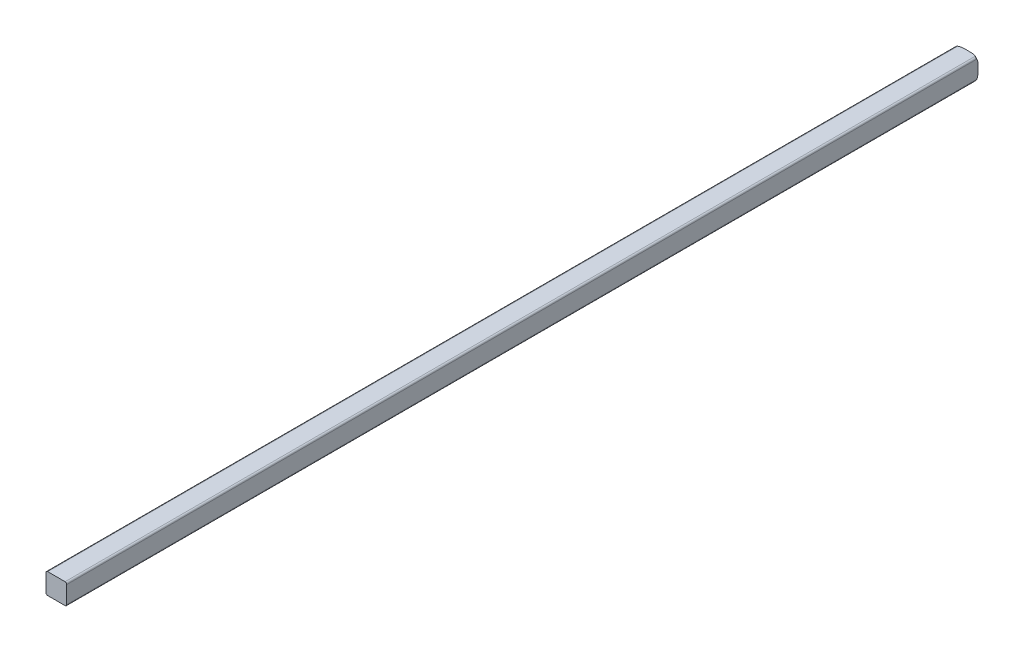
ISO-10303-21;
HEADER;
FILE_DESCRIPTION(('STEP AP214'),'2;1');
FILE_NAME('part.step','',(''),(''),'','','');
FILE_SCHEMA(('AUTOMOTIVE_DESIGN { 1 0 10303 214 1 1 1 1 }'));
ENDSEC;
DATA;
#1=APPLICATION_CONTEXT('core data for automotive mechanical design processes');
#2=APPLICATION_PROTOCOL_DEFINITION('international standard','automotive_design',2000,#1);
#3=PRODUCT_CONTEXT('',#1,'mechanical');
#4=PRODUCT('Part','Part','',(#3));
#5=PRODUCT_RELATED_PRODUCT_CATEGORY('part','',(#4));
#6=PRODUCT_DEFINITION_FORMATION('','',#4);
#7=PRODUCT_DEFINITION_CONTEXT('part definition',#1,'design');
#8=PRODUCT_DEFINITION('design','',#6,#7);
#9=PRODUCT_DEFINITION_SHAPE('','',#8);
#10=(LENGTH_UNIT() NAMED_UNIT(*) SI_UNIT(.MILLI.,.METRE.));
#11=(NAMED_UNIT(*) PLANE_ANGLE_UNIT() SI_UNIT($,.RADIAN.));
#12=(NAMED_UNIT(*) SI_UNIT($,.STERADIAN.) SOLID_ANGLE_UNIT());
#13=UNCERTAINTY_MEASURE_WITH_UNIT(LENGTH_MEASURE(1.E-05),#10,'distance_accuracy_value','');
#14=(GEOMETRIC_REPRESENTATION_CONTEXT(3) GLOBAL_UNCERTAINTY_ASSIGNED_CONTEXT((#13)) GLOBAL_UNIT_ASSIGNED_CONTEXT((#10,
#11,#12)) REPRESENTATION_CONTEXT('',''));
#15=CARTESIAN_POINT('',(0.,0.,0.));
#16=DIRECTION('',(0.,0.,1.));
#17=DIRECTION('',(1.,0.,0.));
#18=AXIS2_PLACEMENT_3D('',#15,#16,#17);
#19=CARTESIAN_POINT('',(0.,0.,-151.765));
#20=DIRECTION('',(0.,0.,1.));
#21=DIRECTION('',(1.,0.,0.));
#22=AXIS2_PLACEMENT_3D('',#19,#20,#21);
#23=TOROIDAL_SURFACE('',#22,1.63185378542452,0.634999999999996);
#24=CARTESIAN_POINT('',(1.5875,-1.33350000000002,-152.221499318016));
#25=CARTESIAN_POINT('',(1.58748566897288,-1.34690792462913,-152.213190238344));
#26=CARTESIAN_POINT('',(1.58643563491714,-1.36046268636275,-152.204973203089));
#27=CARTESIAN_POINT('',(1.58201648662521,-1.38783838491251,-152.189246987089));
#28=CARTESIAN_POINT('',(1.57861670279278,-1.40166046367848,-152.181748678998));
#29=CARTESIAN_POINT('',(1.57058714220896,-1.4252188046148,-152.170181353723));
#30=CARTESIAN_POINT('',(1.56659229292944,-1.43498690476736,-152.165746278129));
#31=CARTESIAN_POINT('',(1.55721249958347,-1.45425932377617,-152.158001433052));
#32=CARTESIAN_POINT('',(1.55183414419048,-1.46376466264462,-152.154686497667));
#33=CARTESIAN_POINT('',(1.54064277647373,-1.48078992954893,-152.14994940311));
#34=CARTESIAN_POINT('',(1.53503704758616,-1.48838416094885,-152.148309241859));
#35=CARTESIAN_POINT('',(1.52291375209377,-1.50299443314631,-152.146252977872));
#36=CARTESIAN_POINT('',(1.51639639905189,-1.51001060875298,-152.145836588948));
#37=CARTESIAN_POINT('',(1.50263078678935,-1.52324184577942,-152.146280429597));
#38=CARTESIAN_POINT('',(1.49538231587763,-1.52945667397997,-152.14714102991));
#39=CARTESIAN_POINT('',(1.48038761855588,-1.54093535352862,-152.150033976363));
#40=CARTESIAN_POINT('',(1.47264109349684,-1.54619862694723,-152.152067031478));
#41=CARTESIAN_POINT('',(1.45446300659162,-1.5571701281181,-152.157864814596));
#42=CARTESIAN_POINT('',(1.44392996611574,-1.56252875091595,-152.161967806468));
#43=CARTESIAN_POINT('',(1.42264994892329,-1.57162418246107,-152.171336771351));
#44=CARTESIAN_POINT('',(1.41190224866778,-1.57535394035416,-152.176607654423));
#45=CARTESIAN_POINT('',(1.38976321513481,-1.58147222213898,-152.188219245468));
#46=CARTESIAN_POINT('',(1.37837092259127,-1.58376977522872,-152.194604434648));
#47=CARTESIAN_POINT('',(1.3557914101953,-1.58677095199112,-152.207801324842));
#48=CARTESIAN_POINT('',(1.34460332096514,-1.58749208945789,-152.214607466425));
#49=CARTESIAN_POINT('',(1.3335,-1.5875,-152.221499318016));
#50=B_SPLINE_CURVE_WITH_KNOTS('',3,(#24,#25,#26,#27,#28,#29,#30,#31,#32,#33,#34,#35,#36,#37,#38,
#39,#40,#41,#42,#43,#44,#45,#46,#47,#48,#49),.UNSPECIFIED.,.F.,.F.,(4,2,2,2,2,2,2,2,2,2,2,2,4),
(0.,0.0474135575383086,0.0954579548319941,0.129685196647684,0.163752362077388,0.192367952546173,
0.220976850534813,0.249594055977996,0.278228584196791,0.315551990426705,0.35303539436927,
0.392706187180639,0.431933953270491),.UNSPECIFIED.);
#51=CARTESIAN_POINT('',(1.58749999999933,-1.33349999999976,-152.221499318016));
#52=VERTEX_POINT('',#51);
#53=CARTESIAN_POINT('',(1.3335,-1.5875,-152.221499318016));
#54=VERTEX_POINT('',#53);
#55=EDGE_CURVE('E138',#52,#54,#50,.T.);
#56=ORIENTED_EDGE('',*,*,#55,.T.);
#57=CARTESIAN_POINT('',(1.3335,-1.5875,-152.221499318016));
#58=CARTESIAN_POINT('',(1.31039310118339,-1.5875,-152.235865299563));
#59=CARTESIAN_POINT('',(1.2865956642968,-1.5875,-152.249048257601));
#60=CARTESIAN_POINT('',(1.23796868030272,-1.5875,-152.273223560389));
#61=CARTESIAN_POINT('',(1.21314134560693,-1.5875,-152.284220334021));
#62=CARTESIAN_POINT('',(1.13821413543875,-1.5875,-152.313985593762));
#63=CARTESIAN_POINT('',(1.08698851455543,-1.58749999999999,-152.329928851037));
#64=CARTESIAN_POINT('',(0.999962751237773,-1.5875,-152.351585586061));
#65=CARTESIAN_POINT('',(0.964535612838002,-1.5875,-152.358939888529));
#66=CARTESIAN_POINT('',(0.893247688923875,-1.5875,-152.371383880132));
#67=CARTESIAN_POINT('',(0.857386498395738,-1.5875,-152.376471254534));
#68=CARTESIAN_POINT('',(0.785399533338715,-1.5875,-152.384831387066));
#69=CARTESIAN_POINT('',(0.749273402082702,-1.5875,-152.388100907212));
#70=CARTESIAN_POINT('',(0.67580173022745,-1.5875,-152.393318963833));
#71=CARTESIAN_POINT('',(0.63845318438633,-1.5875,-152.395223289793));
#72=CARTESIAN_POINT('',(0.563797247200005,-1.5875,-152.397971889239));
#73=CARTESIAN_POINT('',(0.526489923948469,-1.5875,-152.398818284985));
#74=CARTESIAN_POINT('',(0.452078339022184,-1.5875,-152.399825627271));
#75=CARTESIAN_POINT('',(0.414974136365072,-1.5875,-152.399990466567));
#76=CARTESIAN_POINT('',(0.377876338243535,-1.5875,-152.4));
#77=B_SPLINE_CURVE_WITH_KNOTS('',3,(#57,#58,#59,#60,#61,#62,#63,#64,#65,#66,#67,#68,#69,#70,#71,
#72,#73,#74,#75,#76),.UNSPECIFIED.,.F.,.F.,(4,2,2,2,2,2,2,2,2,4),(0.,0.081532624795922,
0.162898354774411,0.323290286001692,0.431774886900742,0.54037000765597,0.649157944635809,
0.761326732026143,0.873270140095039,0.984573284944613),.UNSPECIFIED.);
#78=CARTESIAN_POINT('',(0.377876338243536,-1.5875,-152.4));
#79=VERTEX_POINT('',#78);
#80=EDGE_CURVE('E143',#54,#79,#77,.T.);
#81=ORIENTED_EDGE('',*,*,#80,.T.);
#82=CARTESIAN_POINT('',(0.,0.,-152.4));
#83=DIRECTION('',(0.,0.,1.));
#84=DIRECTION('',(0.231562620143221,-0.97282000028392,0.));
#85=AXIS2_PLACEMENT_3D('',#82,#83,#84);
#86=CIRCLE('',#85,1.63185378542452);
#87=CARTESIAN_POINT('',(1.5875,-0.377876338243537,-152.4));
#88=VERTEX_POINT('',#87);
#89=EDGE_CURVE('E123',#88,#79,#86,.F.);
#90=ORIENTED_EDGE('',*,*,#89,.F.);
#91=CARTESIAN_POINT('',(1.5875,-0.377876338243537,-152.4));
#92=CARTESIAN_POINT('',(1.5875,-0.411612509119624,-152.399993375156));
#93=CARTESIAN_POINT('',(1.5875,-0.445352736805654,-152.399855790265));
#94=CARTESIAN_POINT('',(1.5875,-0.512942907948323,-152.399047840727));
#95=CARTESIAN_POINT('',(1.5875,-0.546792826939158,-152.39837563363));
#96=CARTESIAN_POINT('',(1.5875,-0.614509507764874,-152.396222630311));
#97=CARTESIAN_POINT('',(1.5875,-0.648376243547024,-152.39474089648));
#98=CARTESIAN_POINT('',(1.5875,-0.715189437993939,-152.390705632448));
#99=CARTESIAN_POINT('',(1.5875,-0.748137535690094,-152.388180118227));
#100=CARTESIAN_POINT('',(1.5875,-0.813874511250838,-152.381749739949));
#101=CARTESIAN_POINT('',(1.5875,-0.846663515341609,-152.377846257093));
#102=CARTESIAN_POINT('',(1.5875,-0.911972001446362,-152.368328243334));
#103=CARTESIAN_POINT('',(1.5875,-0.944491567482057,-152.362714268179));
#104=CARTESIAN_POINT('',(1.58750000000001,-1.03884990510625,-152.343295735213));
#105=CARTESIAN_POINT('',(1.58750000000004,-1.10020590566775,-152.326702751592));
#106=CARTESIAN_POINT('',(1.58749999999999,-1.17979261140477,-152.297655047337));
#107=CARTESIAN_POINT('',(1.58749999999997,-1.19970518510335,-152.289722358069));
#108=CARTESIAN_POINT('',(1.58750000000004,-1.23899757921714,-152.272570532428));
#109=CARTESIAN_POINT('',(1.58750000000013,-1.25837690634234,-152.263350249863));
#110=CARTESIAN_POINT('',(1.58749999999987,-1.29648737036626,-152.243502020843));
#111=CARTESIAN_POINT('',(1.58749999999952,-1.31521592279952,-152.232869126592));
#112=CARTESIAN_POINT('',(1.58749999999867,-1.3334999999995,-152.221499318017));
#113=B_SPLINE_CURVE_WITH_KNOTS('',3,(#91,#92,#93,#94,#95,#96,#97,#98,#99,#100,#101,#102,#103,
#104,#105,#106,#107,#108,#109,#110,#111,#112),.UNSPECIFIED.,.F.,.F.,(4,2,2,2,2,2,2,2,2,2,4),(0.,
0.10121457886963,0.202779489233483,0.304462283979961,0.40357684120048,0.502592332234137,
0.601575686961515,0.791402246158581,0.855672419606404,0.920000174261184,0.984559494506425),.UNSPECIFIED.);
#114=EDGE_CURVE('E84',#88,#52,#113,.T.);
#115=ORIENTED_EDGE('',*,*,#114,.T.);
#116=EDGE_LOOP('',(#56,#81,#90,#115));
#117=FACE_BOUND('',#116,.T.);
#118=ADVANCED_FACE('F32',(#117),#23,.T.);
#119=CARTESIAN_POINT('',(0.,0.,-151.765));
#120=DIRECTION('',(0.,0.,1.));
#121=DIRECTION('',(1.,0.,0.));
#122=AXIS2_PLACEMENT_3D('',#119,#120,#121);
#123=TOROIDAL_SURFACE('',#122,1.63185378542452,0.634999999999996);
#124=CARTESIAN_POINT('',(-1.33350000000002,-1.5875,-152.221499318016));
#125=CARTESIAN_POINT('',(-1.34690792462915,-1.58748566897288,-152.213190238344));
#126=CARTESIAN_POINT('',(-1.36046268636276,-1.58643563491714,-152.204973203089));
#127=CARTESIAN_POINT('',(-1.38783838491252,-1.5820164866252,-152.189246987089));
#128=CARTESIAN_POINT('',(-1.40166046367848,-1.57861670279278,-152.181748678998));
#129=CARTESIAN_POINT('',(-1.42521880461481,-1.57058714220896,-152.170181353723));
#130=CARTESIAN_POINT('',(-1.43498690476737,-1.56659229292943,-152.165746278129));
#131=CARTESIAN_POINT('',(-1.45425932377618,-1.55721249958346,-152.158001433052));
#132=CARTESIAN_POINT('',(-1.46376466264463,-1.55183414419047,-152.154686497667));
#133=CARTESIAN_POINT('',(-1.48078992954893,-1.54064277647373,-152.14994940311));
#134=CARTESIAN_POINT('',(-1.48838416094885,-1.53503704758616,-152.148309241859));
#135=CARTESIAN_POINT('',(-1.50299443314631,-1.52291375209376,-152.146252977872));
#136=CARTESIAN_POINT('',(-1.51001060875298,-1.51639639905189,-152.145836588948));
#137=CARTESIAN_POINT('',(-1.52324184577942,-1.50263078678935,-152.146280429597));
#138=CARTESIAN_POINT('',(-1.52945667397997,-1.49538231587763,-152.14714102991));
#139=CARTESIAN_POINT('',(-1.54093535352862,-1.48038761855588,-152.150033976363));
#140=CARTESIAN_POINT('',(-1.54619862694723,-1.47264109349684,-152.152067031478));
#141=CARTESIAN_POINT('',(-1.5571701281181,-1.45446300659162,-152.157864814596));
#142=CARTESIAN_POINT('',(-1.56252875091595,-1.44392996611573,-152.161967806468));
#143=CARTESIAN_POINT('',(-1.57162418246107,-1.42264994892329,-152.171336771351));
#144=CARTESIAN_POINT('',(-1.57535394035416,-1.41190224866778,-152.176607654423));
#145=CARTESIAN_POINT('',(-1.58147222213898,-1.38976321513481,-152.188219245468));
#146=CARTESIAN_POINT('',(-1.58376977522872,-1.37837092259127,-152.194604434648));
#147=CARTESIAN_POINT('',(-1.58677095199112,-1.35579141019531,-152.207801324842));
#148=CARTESIAN_POINT('',(-1.58749208945789,-1.34460332096514,-152.214607466425));
#149=CARTESIAN_POINT('',(-1.5875,-1.3335,-152.221499318016));
#150=B_SPLINE_CURVE_WITH_KNOTS('',3,(#124,#125,#126,#127,#128,#129,#130,#131,#132,#133,#134,
#135,#136,#137,#138,#139,#140,#141,#142,#143,#144,#145,#146,#147,#148,#149),.UNSPECIFIED.,.F.,
.F.,(4,2,2,2,2,2,2,2,2,2,2,2,4),(0.,0.0474135575383209,0.0954579548320188,0.129685196647701,
0.163752362077393,0.192367952546176,0.220976850534816,0.249594055977999,0.278228584196793,
0.315551990426707,0.353035394369273,0.392706187180639,0.431933953270492),.UNSPECIFIED.);
#151=CARTESIAN_POINT('',(-1.33349999999976,-1.58749999999933,-152.221499318016));
#152=VERTEX_POINT('',#151);
#153=CARTESIAN_POINT('',(-1.5875,-1.3335,-152.221499318016));
#154=VERTEX_POINT('',#153);
#155=EDGE_CURVE('E306',#152,#154,#150,.T.);
#156=ORIENTED_EDGE('',*,*,#155,.T.);
#157=CARTESIAN_POINT('',(-1.5875,-1.3335,-152.221499318016));
#158=CARTESIAN_POINT('',(-1.5875,-1.31039310118339,-152.235865299563));
#159=CARTESIAN_POINT('',(-1.5875,-1.2865956642968,-152.249048257601));
#160=CARTESIAN_POINT('',(-1.5875,-1.23796868030272,-152.273223560389));
#161=CARTESIAN_POINT('',(-1.5875,-1.21314134560693,-152.284220334021));
#162=CARTESIAN_POINT('',(-1.5875,-1.13821413543875,-152.313985593762));
#163=CARTESIAN_POINT('',(-1.5875,-1.08698851455543,-152.329928851037));
#164=CARTESIAN_POINT('',(-1.5875,-0.999962751237773,-152.351585586061));
#165=CARTESIAN_POINT('',(-1.5875,-0.964535612838002,-152.358939888529));
#166=CARTESIAN_POINT('',(-1.5875,-0.893247688923874,-152.371383880132));
#167=CARTESIAN_POINT('',(-1.5875,-0.857386498395734,-152.376471254534));
#168=CARTESIAN_POINT('',(-1.5875,-0.785399533338711,-152.384831387066));
#169=CARTESIAN_POINT('',(-1.5875,-0.7492734020827,-152.388100907212));
#170=CARTESIAN_POINT('',(-1.5875,-0.675801730227451,-152.393318963833));
#171=CARTESIAN_POINT('',(-1.5875,-0.63845318438633,-152.395223289793));
#172=CARTESIAN_POINT('',(-1.5875,-0.563797247200005,-152.397971889239));
#173=CARTESIAN_POINT('',(-1.5875,-0.526489923948469,-152.398818284985));
#174=CARTESIAN_POINT('',(-1.5875,-0.452078339022184,-152.399825627271));
#175=CARTESIAN_POINT('',(-1.5875,-0.414974136365072,-152.399990466567));
#176=CARTESIAN_POINT('',(-1.5875,-0.377876338243535,-152.4));
#177=B_SPLINE_CURVE_WITH_KNOTS('',3,(#157,#158,#159,#160,#161,#162,#163,#164,#165,#166,#167,
#168,#169,#170,#171,#172,#173,#174,#175,#176),.UNSPECIFIED.,.F.,.F.,(4,2,2,2,2,2,2,2,2,4),(0.,
0.0815326247959219,0.162898354774411,0.323290286001692,0.431774886900742,0.54037000765597,
0.649157944635808,0.761326732026142,0.873270140095037,0.984573284944611),.UNSPECIFIED.);
#178=CARTESIAN_POINT('',(-1.5875,-0.377876338243537,-152.4));
#179=VERTEX_POINT('',#178);
#180=EDGE_CURVE('E305',#154,#179,#177,.T.);
#181=ORIENTED_EDGE('',*,*,#180,.T.);
#182=CARTESIAN_POINT('',(0.,0.,-152.4));
#183=DIRECTION('',(0.,0.,1.));
#184=DIRECTION('',(-0.97282000028392,-0.231562620143221,0.));
#185=AXIS2_PLACEMENT_3D('',#182,#183,#184);
#186=CIRCLE('',#185,1.63185378542452);
#187=CARTESIAN_POINT('',(-0.377876338243537,-1.5875,-152.4));
#188=VERTEX_POINT('',#187);
#189=EDGE_CURVE('E198',#188,#179,#186,.F.);
#190=ORIENTED_EDGE('',*,*,#189,.F.);
#191=CARTESIAN_POINT('',(-0.377876338243537,-1.5875,-152.4));
#192=CARTESIAN_POINT('',(-0.411612509119624,-1.5875,-152.399993375156));
#193=CARTESIAN_POINT('',(-0.445352736805654,-1.5875,-152.399855790265));
#194=CARTESIAN_POINT('',(-0.512942907948323,-1.5875,-152.399047840727));
#195=CARTESIAN_POINT('',(-0.546792826939158,-1.5875,-152.39837563363));
#196=CARTESIAN_POINT('',(-0.614509507764873,-1.5875,-152.396222630311));
#197=CARTESIAN_POINT('',(-0.648376243547024,-1.5875,-152.39474089648));
#198=CARTESIAN_POINT('',(-0.715189437993939,-1.5875,-152.390705632448));
#199=CARTESIAN_POINT('',(-0.748137535690094,-1.5875,-152.388180118227));
#200=CARTESIAN_POINT('',(-0.813874511250838,-1.5875,-152.381749739949));
#201=CARTESIAN_POINT('',(-0.846663515341609,-1.5875,-152.377846257093));
#202=CARTESIAN_POINT('',(-0.911972001446362,-1.5875,-152.368328243334));
#203=CARTESIAN_POINT('',(-0.944491567482057,-1.5875,-152.362714268179));
#204=CARTESIAN_POINT('',(-1.03884990510625,-1.58750000000001,-152.343295735213));
#205=CARTESIAN_POINT('',(-1.10020590566775,-1.58750000000004,-152.326702751592));
#206=CARTESIAN_POINT('',(-1.17979261140477,-1.58749999999999,-152.297655047337));
#207=CARTESIAN_POINT('',(-1.19970518510335,-1.58749999999997,-152.289722358069));
#208=CARTESIAN_POINT('',(-1.23899757921714,-1.58750000000004,-152.272570532428));
#209=CARTESIAN_POINT('',(-1.25837690634234,-1.58750000000013,-152.263350249863));
#210=CARTESIAN_POINT('',(-1.29648737036626,-1.58749999999987,-152.243502020843));
#211=CARTESIAN_POINT('',(-1.31521592279952,-1.58749999999952,-152.232869126592));
#212=CARTESIAN_POINT('',(-1.3334999999995,-1.58749999999867,-152.221499318017));
#213=B_SPLINE_CURVE_WITH_KNOTS('',3,(#191,#192,#193,#194,#195,#196,#197,#198,#199,#200,#201,
#202,#203,#204,#205,#206,#207,#208,#209,#210,#211,#212),.UNSPECIFIED.,.F.,.F.,(4,2,2,2,2,2,2,2,
2,2,4),(0.,0.10121457886963,0.202779489233483,0.304462283979962,0.40357684120048,
0.502592332234137,0.601575686961515,0.791402246158581,0.855672419606404,0.920000174261183,
0.984559494506424),.UNSPECIFIED.);
#214=EDGE_CURVE('E313',#188,#152,#213,.T.);
#215=ORIENTED_EDGE('',*,*,#214,.T.);
#216=EDGE_LOOP('',(#156,#181,#190,#215));
#217=FACE_BOUND('',#216,.T.);
#218=ADVANCED_FACE('F259',(#217),#123,.T.);
#219=CARTESIAN_POINT('',(0.,0.,-151.765));
#220=DIRECTION('',(0.,0.,1.));
#221=DIRECTION('',(1.,0.,0.));
#222=AXIS2_PLACEMENT_3D('',#219,#220,#221);
#223=TOROIDAL_SURFACE('',#222,1.63185378542452,0.634999999999996);
#224=CARTESIAN_POINT('',(0.,0.,-152.4));
#225=DIRECTION('',(0.,0.,1.));
#226=DIRECTION('',(-0.231562620143221,0.97282000028392,0.));
#227=AXIS2_PLACEMENT_3D('',#224,#225,#226);
#228=CIRCLE('',#227,1.63185378542452);
#229=CARTESIAN_POINT('',(-1.5875,0.377876338243537,-152.4));
#230=VERTEX_POINT('',#229);
#231=CARTESIAN_POINT('',(-0.377876338243537,1.5875,-152.4));
#232=VERTEX_POINT('',#231);
#233=EDGE_CURVE('E211',#230,#232,#228,.F.);
#234=ORIENTED_EDGE('',*,*,#233,.F.);
#235=CARTESIAN_POINT('',(-1.5875,0.377876338243537,-152.4));
#236=CARTESIAN_POINT('',(-1.5875,0.411612509119624,-152.399993375156));
#237=CARTESIAN_POINT('',(-1.5875,0.445352736805655,-152.399855790265));
#238=CARTESIAN_POINT('',(-1.5875,0.512942907948324,-152.399047840727));
#239=CARTESIAN_POINT('',(-1.5875,0.54679282693916,-152.39837563363));
#240=CARTESIAN_POINT('',(-1.5875,0.614509507764876,-152.396222630311));
#241=CARTESIAN_POINT('',(-1.5875,0.648376243547026,-152.39474089648));
#242=CARTESIAN_POINT('',(-1.5875,0.715189437993942,-152.390705632448));
#243=CARTESIAN_POINT('',(-1.5875,0.748137535690097,-152.388180118227));
#244=CARTESIAN_POINT('',(-1.5875,0.813874511250842,-152.381749739949));
#245=CARTESIAN_POINT('',(-1.5875,0.846663515341613,-152.377846257093));
#246=CARTESIAN_POINT('',(-1.5875,0.911972001446366,-152.368328243334));
#247=CARTESIAN_POINT('',(-1.5875,0.944491567482061,-152.362714268179));
#248=CARTESIAN_POINT('',(-1.58750000000001,1.03884990510625,-152.343295735213));
#249=CARTESIAN_POINT('',(-1.58750000000004,1.10020590566775,-152.326702751592));
#250=CARTESIAN_POINT('',(-1.58749999999999,1.17979261140477,-152.297655047337));
#251=CARTESIAN_POINT('',(-1.58749999999997,1.19970518510335,-152.289722358069));
#252=CARTESIAN_POINT('',(-1.58750000000004,1.23899757921714,-152.272570532428));
#253=CARTESIAN_POINT('',(-1.58750000000013,1.25837690634234,-152.263350249863));
#254=CARTESIAN_POINT('',(-1.58749999999987,1.29648737036626,-152.243502020843));
#255=CARTESIAN_POINT('',(-1.58749999999952,1.31521592279952,-152.232869126592));
#256=CARTESIAN_POINT('',(-1.58749999999867,1.3334999999995,-152.221499318017));
#257=B_SPLINE_CURVE_WITH_KNOTS('',3,(#235,#236,#237,#238,#239,#240,#241,#242,#243,#244,#245,
#246,#247,#248,#249,#250,#251,#252,#253,#254,#255,#256),.UNSPECIFIED.,.F.,.F.,(4,2,2,2,2,2,2,2,
2,2,4),(0.,0.101214578869631,0.202779489233485,0.304462283979964,0.403576841200483,
0.502592332234141,0.60157568696152,0.791402246158581,0.855672419606402,0.920000174261184,
0.98455949450642),.UNSPECIFIED.);
#258=CARTESIAN_POINT('',(-1.58749999999933,1.33349999999976,-152.221499318016));
#259=VERTEX_POINT('',#258);
#260=EDGE_CURVE('E131',#230,#259,#257,.T.);
#261=ORIENTED_EDGE('',*,*,#260,.T.);
#262=CARTESIAN_POINT('',(-1.5875,1.33350000000001,-152.221499318016));
#263=CARTESIAN_POINT('',(-1.58748566897288,1.34690792462914,-152.213190238344));
#264=CARTESIAN_POINT('',(-1.58643563491714,1.36046268636276,-152.204973203089));
#265=CARTESIAN_POINT('',(-1.5820164866252,1.38783838491252,-152.189246987089));
#266=CARTESIAN_POINT('',(-1.57861670279278,1.40166046367848,-152.181748678998));
#267=CARTESIAN_POINT('',(-1.57058714220896,1.42521880461481,-152.170181353723));
#268=CARTESIAN_POINT('',(-1.56659229292943,1.43498690476737,-152.165746278129));
#269=CARTESIAN_POINT('',(-1.55721249958346,1.45425932377618,-152.158001433052));
#270=CARTESIAN_POINT('',(-1.55183414419047,1.46376466264463,-152.154686497667));
#271=CARTESIAN_POINT('',(-1.54064277647373,1.48078992954893,-152.14994940311));
#272=CARTESIAN_POINT('',(-1.53503704758616,1.48838416094885,-152.148309241859));
#273=CARTESIAN_POINT('',(-1.52291375209377,1.50299443314631,-152.146252977872));
#274=CARTESIAN_POINT('',(-1.51639639905189,1.51001060875298,-152.145836588948));
#275=CARTESIAN_POINT('',(-1.50263078678935,1.52324184577942,-152.146280429597));
#276=CARTESIAN_POINT('',(-1.49538231587763,1.52945667397997,-152.14714102991));
#277=CARTESIAN_POINT('',(-1.48038761855588,1.54093535352862,-152.150033976363));
#278=CARTESIAN_POINT('',(-1.47264109349684,1.54619862694723,-152.152067031478));
#279=CARTESIAN_POINT('',(-1.45446300659162,1.5571701281181,-152.157864814596));
#280=CARTESIAN_POINT('',(-1.44392996611573,1.56252875091595,-152.161967806468));
#281=CARTESIAN_POINT('',(-1.42264994892329,1.57162418246107,-152.171336771351));
#282=CARTESIAN_POINT('',(-1.41190224866778,1.57535394035416,-152.176607654423));
#283=CARTESIAN_POINT('',(-1.38976321513481,1.58147222213898,-152.188219245468));
#284=CARTESIAN_POINT('',(-1.37837092259127,1.58376977522872,-152.194604434648));
#285=CARTESIAN_POINT('',(-1.35579141019531,1.58677095199112,-152.207801324842));
#286=CARTESIAN_POINT('',(-1.34460332096514,1.58749208945789,-152.214607466425));
#287=CARTESIAN_POINT('',(-1.3335,1.5875,-152.221499318016));
#288=B_SPLINE_CURVE_WITH_KNOTS('',3,(#262,#263,#264,#265,#266,#267,#268,#269,#270,#271,#272,
#273,#274,#275,#276,#277,#278,#279,#280,#281,#282,#283,#284,#285,#286,#287),.UNSPECIFIED.,.F.,
.F.,(4,2,2,2,2,2,2,2,2,2,2,2,4),(0.,0.0474135575383211,0.0954579548320196,0.129685196647705,
0.163752362077394,0.192367952546178,0.220976850534818,0.249594055978,0.278228584196795,
0.315551990426712,0.353035394369274,0.392706187180643,0.431933953270495),.UNSPECIFIED.);
#289=CARTESIAN_POINT('',(-1.3335,1.5875,-152.221499318016));
#290=VERTEX_POINT('',#289);
#291=EDGE_CURVE('E369',#259,#290,#288,.T.);
#292=ORIENTED_EDGE('',*,*,#291,.T.);
#293=CARTESIAN_POINT('',(-1.3335,1.5875,-152.221499318016));
#294=CARTESIAN_POINT('',(-1.31039310118339,1.5875,-152.235865299563));
#295=CARTESIAN_POINT('',(-1.2865956642968,1.5875,-152.249048257601));
#296=CARTESIAN_POINT('',(-1.23796868030272,1.5875,-152.273223560389));
#297=CARTESIAN_POINT('',(-1.21314134560693,1.5875,-152.284220334021));
#298=CARTESIAN_POINT('',(-1.13821413543875,1.5875,-152.313985593762));
#299=CARTESIAN_POINT('',(-1.08698851455543,1.5875,-152.329928851037));
#300=CARTESIAN_POINT('',(-0.999962751237773,1.5875,-152.351585586061));
#301=CARTESIAN_POINT('',(-0.964535612838003,1.5875,-152.358939888529));
#302=CARTESIAN_POINT('',(-0.893247688923874,1.5875,-152.371383880132));
#303=CARTESIAN_POINT('',(-0.857386498395734,1.5875,-152.376471254534));
#304=CARTESIAN_POINT('',(-0.785399533338711,1.5875,-152.384831387066));
#305=CARTESIAN_POINT('',(-0.749273402082701,1.5875,-152.388100907212));
#306=CARTESIAN_POINT('',(-0.675801730227451,1.5875,-152.393318963833));
#307=CARTESIAN_POINT('',(-0.63845318438633,1.5875,-152.395223289793));
#308=CARTESIAN_POINT('',(-0.563797247200005,1.5875,-152.397971889239));
#309=CARTESIAN_POINT('',(-0.526489923948469,1.5875,-152.398818284985));
#310=CARTESIAN_POINT('',(-0.452078339022184,1.5875,-152.399825627271));
#311=CARTESIAN_POINT('',(-0.414974136365072,1.5875,-152.399990466567));
#312=CARTESIAN_POINT('',(-0.377876338243535,1.5875,-152.4));
#313=B_SPLINE_CURVE_WITH_KNOTS('',3,(#293,#294,#295,#296,#297,#298,#299,#300,#301,#302,#303,
#304,#305,#306,#307,#308,#309,#310,#311,#312),.UNSPECIFIED.,.F.,.F.,(4,2,2,2,2,2,2,2,2,4),(0.,
0.081532624795922,0.162898354774412,0.323290286001692,0.431774886900742,0.540370007655971,
0.649157944635808,0.761326732026142,0.873270140095038,0.984573284944611),.UNSPECIFIED.);
#314=EDGE_CURVE('E285',#290,#232,#313,.T.);
#315=ORIENTED_EDGE('',*,*,#314,.T.);
#316=EDGE_LOOP('',(#234,#261,#292,#315));
#317=FACE_BOUND('',#316,.T.);
#318=ADVANCED_FACE('F256',(#317),#223,.T.);
#319=CARTESIAN_POINT('',(-1.5875,1.5875,-152.4));
#320=DIRECTION('',(0.,0.,-1.));
#321=DIRECTION('',(-1.,0.,0.));
#322=AXIS2_PLACEMENT_3D('',#319,#320,#321);
#323=PLANE('',#322);
#324=DIRECTION('',(-1.,0.,0.));
#325=VECTOR('',#324,1.);
#326=CARTESIAN_POINT('',(-1.5875,1.5875,-152.4));
#327=LINE('',#326,#325);
#328=CARTESIAN_POINT('',(0.377876338243537,1.5875,-152.4));
#329=VERTEX_POINT('',#328);
#330=EDGE_CURVE('E224',#232,#329,#327,.F.);
#331=ORIENTED_EDGE('',*,*,#330,.T.);
#332=CARTESIAN_POINT('',(0.,0.,-152.4));
#333=DIRECTION('',(0.,0.,1.));
#334=DIRECTION('',(0.97282000028392,0.231562620143221,0.));
#335=AXIS2_PLACEMENT_3D('',#332,#333,#334);
#336=CIRCLE('',#335,1.63185378542452);
#337=CARTESIAN_POINT('',(1.5875,0.377876338243537,-152.4));
#338=VERTEX_POINT('',#337);
#339=EDGE_CURVE('E127',#338,#329,#336,.T.);
#340=ORIENTED_EDGE('',*,*,#339,.F.);
#341=DIRECTION('',(0.,1.,0.));
#342=VECTOR('',#341,1.);
#343=CARTESIAN_POINT('',(1.5875,1.5875,-152.4));
#344=LINE('',#343,#342);
#345=EDGE_CURVE('E121',#338,#88,#344,.F.);
#346=ORIENTED_EDGE('',*,*,#345,.T.);
#347=ORIENTED_EDGE('',*,*,#89,.T.);
#348=DIRECTION('',(-1.,0.,0.));
#349=VECTOR('',#348,1.);
#350=CARTESIAN_POINT('',(-1.5875,-1.5875,-152.4));
#351=LINE('',#350,#349);
#352=EDGE_CURVE('E144',#79,#188,#351,.T.);
#353=ORIENTED_EDGE('',*,*,#352,.T.);
#354=ORIENTED_EDGE('',*,*,#189,.T.);
#355=DIRECTION('',(0.,1.,0.));
#356=VECTOR('',#355,1.);
#357=CARTESIAN_POINT('',(-1.5875,1.5875,-152.4));
#358=LINE('',#357,#356);
#359=EDGE_CURVE('E233',#179,#230,#358,.T.);
#360=ORIENTED_EDGE('',*,*,#359,.T.);
#361=ORIENTED_EDGE('',*,*,#233,.T.);
#362=EDGE_LOOP('',(#331,#340,#346,#347,#353,#354,#360,#361));
#363=FACE_BOUND('',#362,.T.);
#364=ADVANCED_FACE('F122',(#363),#323,.T.);
#365=CARTESIAN_POINT('',(0.,0.,-151.765));
#366=DIRECTION('',(0.,0.,1.));
#367=DIRECTION('',(1.,0.,0.));
#368=AXIS2_PLACEMENT_3D('',#365,#366,#367);
#369=TOROIDAL_SURFACE('',#368,1.63185378542452,0.634999999999996);
#370=CARTESIAN_POINT('',(1.5875,1.3335,-152.221499318016));
#371=CARTESIAN_POINT('',(1.58748566897288,1.34690792462912,-152.213190238344));
#372=CARTESIAN_POINT('',(1.58643563491714,1.36046268636274,-152.204973203089));
#373=CARTESIAN_POINT('',(1.58201648662521,1.38783838491251,-152.189246987089));
#374=CARTESIAN_POINT('',(1.57861670279278,1.40166046367848,-152.181748678998));
#375=CARTESIAN_POINT('',(1.57058714220896,1.4252188046148,-152.170181353723));
#376=CARTESIAN_POINT('',(1.56659229292944,1.43498690476736,-152.165746278129));
#377=CARTESIAN_POINT('',(1.55721249958346,1.45425932377617,-152.158001433052));
#378=CARTESIAN_POINT('',(1.55183414419047,1.46376466264463,-152.154686497667));
#379=CARTESIAN_POINT('',(1.54064277647373,1.48078992954893,-152.14994940311));
#380=CARTESIAN_POINT('',(1.53503704758616,1.48838416094885,-152.148309241859));
#381=CARTESIAN_POINT('',(1.52291375209376,1.50299443314631,-152.146252977872));
#382=CARTESIAN_POINT('',(1.51639639905189,1.51001060875298,-152.145836588948));
#383=CARTESIAN_POINT('',(1.50263078678935,1.52324184577942,-152.146280429597));
#384=CARTESIAN_POINT('',(1.49538231587763,1.52945667397997,-152.14714102991));
#385=CARTESIAN_POINT('',(1.48038761855587,1.54093535352862,-152.150033976363));
#386=CARTESIAN_POINT('',(1.47264109349684,1.54619862694723,-152.152067031478));
#387=CARTESIAN_POINT('',(1.45446300659162,1.5571701281181,-152.157864814596));
#388=CARTESIAN_POINT('',(1.44392996611573,1.56252875091595,-152.161967806468));
#389=CARTESIAN_POINT('',(1.42264994892329,1.57162418246107,-152.171336771351));
#390=CARTESIAN_POINT('',(1.41190224866778,1.57535394035416,-152.176607654423));
#391=CARTESIAN_POINT('',(1.38976321513481,1.58147222213898,-152.188219245468));
#392=CARTESIAN_POINT('',(1.37837092259127,1.58376977522872,-152.194604434648));
#393=CARTESIAN_POINT('',(1.35579141019531,1.58677095199112,-152.207801324842));
#394=CARTESIAN_POINT('',(1.34460332096514,1.58749208945789,-152.214607466425));
#395=CARTESIAN_POINT('',(1.33350000000001,1.5875,-152.221499318016));
#396=B_SPLINE_CURVE_WITH_KNOTS('',3,(#370,#371,#372,#373,#374,#375,#376,#377,#378,#379,#380,
#381,#382,#383,#384,#385,#386,#387,#388,#389,#390,#391,#392,#393,#394,#395),.UNSPECIFIED.,.F.,
.F.,(4,2,2,2,2,2,2,2,2,2,2,2,4),(0.,0.0474135575383178,0.0954579548320112,0.129685196647701,
0.163752362077405,0.192367952546189,0.220976850534829,0.249594055978012,0.278228584196807,
0.315551990426721,0.353035394369287,0.392706187180649,0.431933953270494),.UNSPECIFIED.);
#397=CARTESIAN_POINT('',(1.5875,1.3335,-152.221499318016));
#398=VERTEX_POINT('',#397);
#399=CARTESIAN_POINT('',(1.33349999999976,1.58749999999933,-152.221499318016));
#400=VERTEX_POINT('',#399);
#401=EDGE_CURVE('E151',#398,#400,#396,.T.);
#402=ORIENTED_EDGE('',*,*,#401,.F.);
#403=CARTESIAN_POINT('',(1.5875,1.3335,-152.221499318016));
#404=CARTESIAN_POINT('',(1.5875,1.31039310118339,-152.235865299563));
#405=CARTESIAN_POINT('',(1.5875,1.2865956642968,-152.249048257601));
#406=CARTESIAN_POINT('',(1.5875,1.23796868030272,-152.273223560389));
#407=CARTESIAN_POINT('',(1.5875,1.21314134560693,-152.284220334021));
#408=CARTESIAN_POINT('',(1.5875,1.13821413543875,-152.313985593762));
#409=CARTESIAN_POINT('',(1.5875,1.08698851455543,-152.329928851037));
#410=CARTESIAN_POINT('',(1.5875,0.999962751237772,-152.351585586061));
#411=CARTESIAN_POINT('',(1.5875,0.964535612838001,-152.358939888529));
#412=CARTESIAN_POINT('',(1.5875,0.893247688923875,-152.371383880132));
#413=CARTESIAN_POINT('',(1.5875,0.857386498395737,-152.376471254534));
#414=CARTESIAN_POINT('',(1.5875,0.785399533338715,-152.384831387066));
#415=CARTESIAN_POINT('',(1.5875,0.749273402082702,-152.388100907212));
#416=CARTESIAN_POINT('',(1.5875,0.67580173022745,-152.393318963833));
#417=CARTESIAN_POINT('',(1.5875,0.63845318438633,-152.395223289793));
#418=CARTESIAN_POINT('',(1.5875,0.563797247200005,-152.397971889239));
#419=CARTESIAN_POINT('',(1.5875,0.526489923948469,-152.398818284985));
#420=CARTESIAN_POINT('',(1.5875,0.452078339022184,-152.399825627271));
#421=CARTESIAN_POINT('',(1.5875,0.414974136365072,-152.399990466567));
#422=CARTESIAN_POINT('',(1.5875,0.377876338243535,-152.4));
#423=B_SPLINE_CURVE_WITH_KNOTS('',3,(#403,#404,#405,#406,#407,#408,#409,#410,#411,#412,#413,
#414,#415,#416,#417,#418,#419,#420,#421,#422),.UNSPECIFIED.,.F.,.F.,(4,2,2,2,2,2,2,2,2,4),(0.,
0.081532624795922,0.162898354774411,0.323290286001692,0.431774886900742,0.54037000765597,
0.649157944635809,0.761326732026143,0.873270140095038,0.984573284944612),.UNSPECIFIED.);
#424=EDGE_CURVE('E423',#398,#338,#423,.T.);
#425=ORIENTED_EDGE('',*,*,#424,.T.);
#426=ORIENTED_EDGE('',*,*,#339,.T.);
#427=CARTESIAN_POINT('',(0.377876338243537,1.5875,-152.4));
#428=CARTESIAN_POINT('',(0.411612509119624,1.5875,-152.399993375156));
#429=CARTESIAN_POINT('',(0.445352736805654,1.5875,-152.399855790265));
#430=CARTESIAN_POINT('',(0.512942907948323,1.5875,-152.399047840727));
#431=CARTESIAN_POINT('',(0.546792826939159,1.5875,-152.39837563363));
#432=CARTESIAN_POINT('',(0.614509507764874,1.5875,-152.396222630311));
#433=CARTESIAN_POINT('',(0.648376243547024,1.5875,-152.39474089648));
#434=CARTESIAN_POINT('',(0.71518943799394,1.5875,-152.390705632448));
#435=CARTESIAN_POINT('',(0.748137535690095,1.5875,-152.388180118227));
#436=CARTESIAN_POINT('',(0.81387451125084,1.5875,-152.381749739949));
#437=CARTESIAN_POINT('',(0.846663515341611,1.5875,-152.377846257093));
#438=CARTESIAN_POINT('',(0.911972001446363,1.5875,-152.368328243334));
#439=CARTESIAN_POINT('',(0.944491567482058,1.5875,-152.362714268179));
#440=CARTESIAN_POINT('',(1.03884990510625,1.58750000000001,-152.343295735213));
#441=CARTESIAN_POINT('',(1.10020590566775,1.58750000000004,-152.326702751592));
#442=CARTESIAN_POINT('',(1.17979261140477,1.58749999999999,-152.297655047337));
#443=CARTESIAN_POINT('',(1.19970518510335,1.58749999999997,-152.289722358069));
#444=CARTESIAN_POINT('',(1.23899757921714,1.58750000000004,-152.272570532428));
#445=CARTESIAN_POINT('',(1.25837690634233,1.58750000000013,-152.263350249863));
#446=CARTESIAN_POINT('',(1.29648737036626,1.58749999999987,-152.243502020843));
#447=CARTESIAN_POINT('',(1.31521592279952,1.58749999999952,-152.232869126592));
#448=CARTESIAN_POINT('',(1.3334999999995,1.58749999999867,-152.221499318017));
#449=B_SPLINE_CURVE_WITH_KNOTS('',3,(#427,#428,#429,#430,#431,#432,#433,#434,#435,#436,#437,
#438,#439,#440,#441,#442,#443,#444,#445,#446,#447,#448),.UNSPECIFIED.,.F.,.F.,(4,2,2,2,2,2,2,2,
2,2,4),(0.,0.10121457886963,0.202779489233484,0.304462283979963,0.403576841200482,
0.502592332234139,0.601575686961517,0.791402246158581,0.855672419606404,0.920000174261183,
0.984559494506424),.UNSPECIFIED.);
#450=EDGE_CURVE('E165',#329,#400,#449,.T.);
#451=ORIENTED_EDGE('',*,*,#450,.T.);
#452=EDGE_LOOP('',(#402,#425,#426,#451));
#453=FACE_BOUND('',#452,.T.);
#454=ADVANCED_FACE('F171',(#453),#369,.T.);
#455=CARTESIAN_POINT('',(-1.5875,1.5875,152.4));
#456=DIRECTION('',(0.,-1.,0.));
#457=DIRECTION('',(0.,0.,-1.));
#458=AXIS2_PLACEMENT_3D('',#455,#456,#457);
#459=PLANE('',#458);
#460=DIRECTION('',(0.,0.,-1.));
#461=VECTOR('',#460,1.);
#462=CARTESIAN_POINT('',(-1.33350000000002,1.5875,152.4));
#463=LINE('',#462,#461);
#464=CARTESIAN_POINT('',(-1.33349999999988,1.5875,-12.9496675796954));
#465=VERTEX_POINT('',#464);
#466=EDGE_CURVE('E387',#465,#290,#463,.T.);
#467=ORIENTED_EDGE('',*,*,#466,.F.);
#468=DIRECTION('',(1.,0.,0.));
#469=VECTOR('',#468,1.);
#470=CARTESIAN_POINT('',(-1.5875,1.5875,-12.9496675796954));
#471=LINE('',#470,#469);
#472=CARTESIAN_POINT('',(1.33349999999988,1.5875,-12.9496675796954));
#473=VERTEX_POINT('',#472);
#474=EDGE_CURVE('E92',#465,#473,#471,.T.);
#475=ORIENTED_EDGE('',*,*,#474,.T.);
#476=DIRECTION('',(0.,0.,-1.));
#477=VECTOR('',#476,1.);
#478=CARTESIAN_POINT('',(1.33350000000002,1.5875,152.4));
#479=LINE('',#478,#477);
#480=EDGE_CURVE('E164',#400,#473,#479,.F.);
#481=ORIENTED_EDGE('',*,*,#480,.F.);
#482=ORIENTED_EDGE('',*,*,#450,.F.);
#483=ORIENTED_EDGE('',*,*,#330,.F.);
#484=ORIENTED_EDGE('',*,*,#314,.F.);
#485=EDGE_LOOP('',(#467,#475,#481,#482,#483,#484));
#486=FACE_BOUND('',#485,.T.);
#487=ADVANCED_FACE('F176',(#486),#459,.F.);
#488=CARTESIAN_POINT('',(1.3335,1.3335,152.4));
#489=DIRECTION('',(0.,0.,-1.));
#490=DIRECTION('',(-1.,0.,0.));
#491=AXIS2_PLACEMENT_3D('',#488,#489,#490);
#492=CYLINDRICAL_SURFACE('',#491,0.254);
#493=CARTESIAN_POINT('',(1.3335,1.3335,-12.9496675796954));
#494=DIRECTION('',(0.,0.,-1.));
#495=DIRECTION('',(-1.,0.,0.));
#496=AXIS2_PLACEMENT_3D('',#493,#494,#495);
#497=CIRCLE('',#496,0.254);
#498=CARTESIAN_POINT('',(1.5875,1.33349999999988,-12.9496675796954));
#499=VERTEX_POINT('',#498);
#500=EDGE_CURVE('E405',#499,#473,#497,.F.);
#501=ORIENTED_EDGE('',*,*,#500,.F.);
#502=DIRECTION('',(0.,0.,1.));
#503=VECTOR('',#502,1.);
#504=CARTESIAN_POINT('',(1.5875,1.33350000000002,152.4));
#505=LINE('',#504,#503);
#506=EDGE_CURVE('E56',#499,#398,#505,.F.);
#507=ORIENTED_EDGE('',*,*,#506,.T.);
#508=ORIENTED_EDGE('',*,*,#401,.T.);
#509=ORIENTED_EDGE('',*,*,#480,.T.);
#510=EDGE_LOOP('',(#501,#507,#508,#509));
#511=FACE_BOUND('',#510,.T.);
#512=ADVANCED_FACE('F167',(#511),#492,.T.);
#513=CARTESIAN_POINT('',(-1.3335,1.3335,152.4));
#514=DIRECTION('',(0.,0.,-1.));
#515=DIRECTION('',(-1.,0.,0.));
#516=AXIS2_PLACEMENT_3D('',#513,#514,#515);
#517=CYLINDRICAL_SURFACE('',#516,0.254);
#518=CARTESIAN_POINT('',(-1.3335,1.3335,-12.9496675796954));
#519=DIRECTION('',(0.,0.,-1.));
#520=DIRECTION('',(-1.,0.,0.));
#521=AXIS2_PLACEMENT_3D('',#518,#519,#520);
#522=CIRCLE('',#521,0.254);
#523=CARTESIAN_POINT('',(-1.5875,1.33349999999988,-12.9496675796954));
#524=VERTEX_POINT('',#523);
#525=EDGE_CURVE('E139',#465,#524,#522,.F.);
#526=ORIENTED_EDGE('',*,*,#525,.F.);
#527=ORIENTED_EDGE('',*,*,#466,.T.);
#528=ORIENTED_EDGE('',*,*,#291,.F.);
#529=DIRECTION('',(0.,0.,-1.));
#530=VECTOR('',#529,1.);
#531=CARTESIAN_POINT('',(-1.5875,1.33350000000002,152.4));
#532=LINE('',#531,#530);
#533=EDGE_CURVE('E390',#259,#524,#532,.F.);
#534=ORIENTED_EDGE('',*,*,#533,.T.);
#535=EDGE_LOOP('',(#526,#527,#528,#534));
#536=FACE_BOUND('',#535,.T.);
#537=ADVANCED_FACE('F377',(#536),#517,.T.);
#538=CARTESIAN_POINT('',(1.5875,-1.5875,152.4));
#539=DIRECTION('',(-1.,0.,0.));
#540=DIRECTION('',(0.,0.,1.));
#541=AXIS2_PLACEMENT_3D('',#538,#539,#540);
#542=PLANE('',#541);
#543=ORIENTED_EDGE('',*,*,#506,.F.);
#544=DIRECTION('',(0.,-1.,0.));
#545=VECTOR('',#544,1.);
#546=CARTESIAN_POINT('',(1.5875,-1.5875,-12.9496675796954));
#547=LINE('',#546,#545);
#548=CARTESIAN_POINT('',(1.5875,-1.33349999999988,-12.9496675796954));
#549=VERTEX_POINT('',#548);
#550=EDGE_CURVE('E407',#499,#549,#547,.T.);
#551=ORIENTED_EDGE('',*,*,#550,.T.);
#552=DIRECTION('',(0.,0.,-1.));
#553=VECTOR('',#552,1.);
#554=CARTESIAN_POINT('',(1.5875,-1.33350000000002,152.4));
#555=LINE('',#554,#553);
#556=EDGE_CURVE('E136',#52,#549,#555,.F.);
#557=ORIENTED_EDGE('',*,*,#556,.F.);
#558=ORIENTED_EDGE('',*,*,#114,.F.);
#559=ORIENTED_EDGE('',*,*,#345,.F.);
#560=ORIENTED_EDGE('',*,*,#424,.F.);
#561=EDGE_LOOP('',(#543,#551,#557,#558,#559,#560));
#562=FACE_BOUND('',#561,.T.);
#563=ADVANCED_FACE('F133',(#562),#542,.F.);
#564=CARTESIAN_POINT('',(-1.5875,-1.5875,152.4));
#565=DIRECTION('',(1.,0.,0.));
#566=DIRECTION('',(0.,0.,-1.));
#567=AXIS2_PLACEMENT_3D('',#564,#565,#566);
#568=PLANE('',#567);
#569=DIRECTION('',(0.,0.,-1.));
#570=VECTOR('',#569,1.);
#571=CARTESIAN_POINT('',(-1.5875,-1.3335,152.4));
#572=LINE('',#571,#570);
#573=CARTESIAN_POINT('',(-1.5875,-1.3335,-12.9496675796954));
#574=VERTEX_POINT('',#573);
#575=EDGE_CURVE('E400',#574,#154,#572,.T.);
#576=ORIENTED_EDGE('',*,*,#575,.F.);
#577=DIRECTION('',(0.,-1.,0.));
#578=VECTOR('',#577,1.);
#579=CARTESIAN_POINT('',(-1.5875,13.7833198887165,-12.9496675796954));
#580=LINE('',#579,#578);
#581=EDGE_CURVE('E413',#524,#574,#580,.T.);
#582=ORIENTED_EDGE('',*,*,#581,.F.);
#583=ORIENTED_EDGE('',*,*,#533,.F.);
#584=ORIENTED_EDGE('',*,*,#260,.F.);
#585=ORIENTED_EDGE('',*,*,#359,.F.);
#586=ORIENTED_EDGE('',*,*,#180,.F.);
#587=EDGE_LOOP('',(#576,#582,#583,#584,#585,#586));
#588=FACE_BOUND('',#587,.T.);
#589=ADVANCED_FACE('F286',(#588),#568,.F.);
#590=CARTESIAN_POINT('',(1.3335,-1.3335,152.4));
#591=DIRECTION('',(0.,0.,-1.));
#592=DIRECTION('',(-1.,0.,0.));
#593=AXIS2_PLACEMENT_3D('',#590,#591,#592);
#594=CYLINDRICAL_SURFACE('',#593,0.254);
#595=CARTESIAN_POINT('',(1.3335,-1.3335,-12.9496675796954));
#596=DIRECTION('',(0.,0.,-1.));
#597=DIRECTION('',(-1.,0.,0.));
#598=AXIS2_PLACEMENT_3D('',#595,#596,#597);
#599=CIRCLE('',#598,0.254);
#600=CARTESIAN_POINT('',(1.33349999999988,-1.5875,-12.9496675796954));
#601=VERTEX_POINT('',#600);
#602=EDGE_CURVE('E409',#601,#549,#599,.F.);
#603=ORIENTED_EDGE('',*,*,#602,.F.);
#604=DIRECTION('',(0.,0.,1.));
#605=VECTOR('',#604,1.);
#606=CARTESIAN_POINT('',(1.33350000000002,-1.5875,152.4));
#607=LINE('',#606,#605);
#608=EDGE_CURVE('E352',#601,#54,#607,.F.);
#609=ORIENTED_EDGE('',*,*,#608,.T.);
#610=ORIENTED_EDGE('',*,*,#55,.F.);
#611=ORIENTED_EDGE('',*,*,#556,.T.);
#612=EDGE_LOOP('',(#603,#609,#610,#611));
#613=FACE_BOUND('',#612,.T.);
#614=ADVANCED_FACE('F291',(#613),#594,.T.);
#615=CARTESIAN_POINT('',(-1.3335,-1.3335,152.4));
#616=DIRECTION('',(0.,0.,-1.));
#617=DIRECTION('',(-1.,0.,0.));
#618=AXIS2_PLACEMENT_3D('',#615,#616,#617);
#619=CYLINDRICAL_SURFACE('',#618,0.254);
#620=CARTESIAN_POINT('',(-1.3335,-1.3335,-12.9496675796954));
#621=DIRECTION('',(0.,0.,-1.));
#622=DIRECTION('',(-1.,0.,0.));
#623=AXIS2_PLACEMENT_3D('',#620,#621,#622);
#624=CIRCLE('',#623,0.254);
#625=CARTESIAN_POINT('',(-1.33350000000002,-1.5875,-12.9496675796954));
#626=VERTEX_POINT('',#625);
#627=EDGE_CURVE('E48',#574,#626,#624,.F.);
#628=ORIENTED_EDGE('',*,*,#627,.F.);
#629=ORIENTED_EDGE('',*,*,#575,.T.);
#630=ORIENTED_EDGE('',*,*,#155,.F.);
#631=DIRECTION('',(0.,0.,1.));
#632=VECTOR('',#631,1.);
#633=CARTESIAN_POINT('',(-1.33350000000002,-1.5875,152.4));
#634=LINE('',#633,#632);
#635=EDGE_CURVE('E41',#152,#626,#634,.T.);
#636=ORIENTED_EDGE('',*,*,#635,.T.);
#637=EDGE_LOOP('',(#628,#629,#630,#636));
#638=FACE_BOUND('',#637,.T.);
#639=ADVANCED_FACE('F315',(#638),#619,.T.);
#640=CARTESIAN_POINT('',(-1.5875,-1.5875,152.4));
#641=DIRECTION('',(0.,1.,0.));
#642=DIRECTION('',(0.,0.,1.));
#643=AXIS2_PLACEMENT_3D('',#640,#641,#642);
#644=PLANE('',#643);
#645=ORIENTED_EDGE('',*,*,#608,.F.);
#646=DIRECTION('',(-1.,0.,0.));
#647=VECTOR('',#646,1.);
#648=CARTESIAN_POINT('',(-1.5875,-1.5875,-12.9496675796954));
#649=LINE('',#648,#647);
#650=EDGE_CURVE('E11',#601,#626,#649,.T.);
#651=ORIENTED_EDGE('',*,*,#650,.T.);
#652=ORIENTED_EDGE('',*,*,#635,.F.);
#653=ORIENTED_EDGE('',*,*,#214,.F.);
#654=ORIENTED_EDGE('',*,*,#352,.F.);
#655=ORIENTED_EDGE('',*,*,#80,.F.);
#656=EDGE_LOOP('',(#645,#651,#652,#653,#654,#655));
#657=FACE_BOUND('',#656,.T.);
#658=ADVANCED_FACE('F319',(#657),#644,.F.);
#659=CARTESIAN_POINT('',(2.08789099172827,13.7833198887165,-12.9496675796954));
#660=DIRECTION('',(0.,0.,-1.));
#661=DIRECTION('',(-1.,0.,0.));
#662=AXIS2_PLACEMENT_3D('',#659,#660,#661);
#663=PLANE('',#662);
#664=ORIENTED_EDGE('',*,*,#525,.T.);
#665=ORIENTED_EDGE('',*,*,#581,.T.);
#666=ORIENTED_EDGE('',*,*,#627,.T.);
#667=ORIENTED_EDGE('',*,*,#650,.F.);
#668=ORIENTED_EDGE('',*,*,#602,.T.);
#669=ORIENTED_EDGE('',*,*,#550,.F.);
#670=ORIENTED_EDGE('',*,*,#500,.T.);
#671=ORIENTED_EDGE('',*,*,#474,.F.);
#672=EDGE_LOOP('',(#664,#665,#666,#667,#668,#669,#670,#671));
#673=FACE_BOUND('',#672,.T.);
#674=ADVANCED_FACE('F324',(#673),#663,.F.);
#675=CLOSED_SHELL('',(#118,#218,#318,#364,#454,#487,#512,#537,#563,#589,#614,#639,#658,#674));
#676=MANIFOLD_SOLID_BREP('B2',#675);
#677=ADVANCED_BREP_SHAPE_REPRESENTATION('',(#18,#676),#14);
#678=SHAPE_DEFINITION_REPRESENTATION(#9,#677);
ENDSEC;
END-ISO-10303-21;
